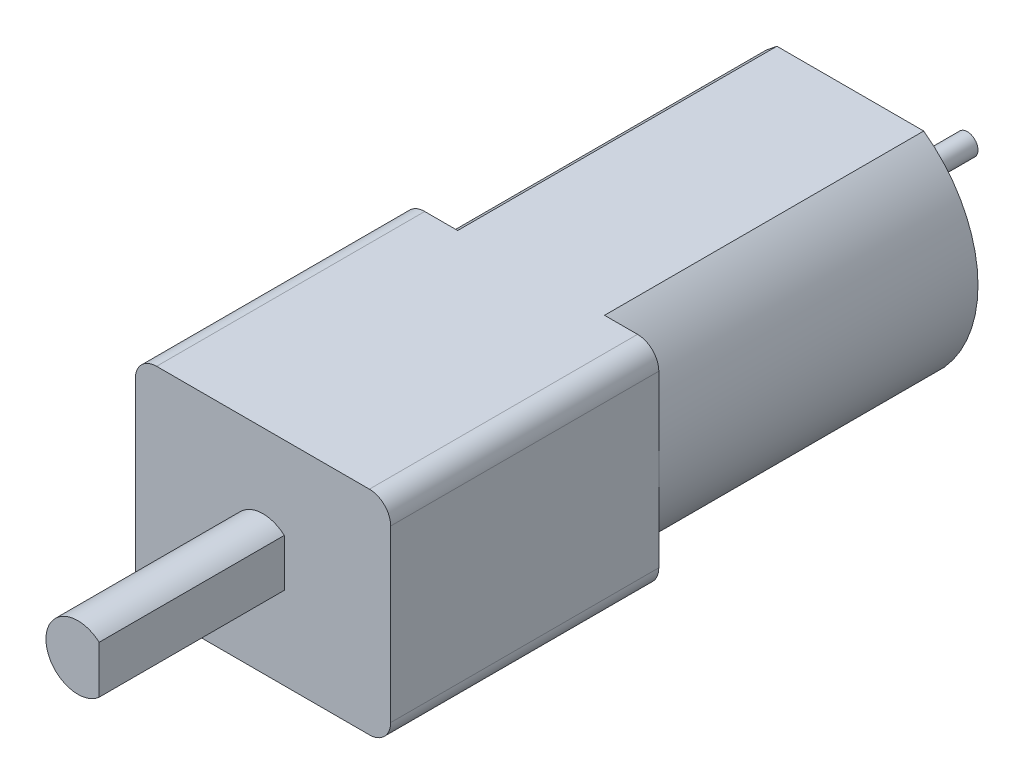
ISO-10303-21;
HEADER;
FILE_DESCRIPTION(('STEP AP214'),'2;1');
FILE_NAME('part.step','',(''),(''),'','','');
FILE_SCHEMA(('AUTOMOTIVE_DESIGN { 1 0 10303 214 1 1 1 1 }'));
ENDSEC;
DATA;
#1=APPLICATION_CONTEXT('core data for automotive mechanical design processes');
#2=APPLICATION_PROTOCOL_DEFINITION('international standard','automotive_design',2000,#1);
#3=PRODUCT_CONTEXT('',#1,'mechanical');
#4=PRODUCT('Part','Part','',(#3));
#5=PRODUCT_RELATED_PRODUCT_CATEGORY('part','',(#4));
#6=PRODUCT_DEFINITION_FORMATION('','',#4);
#7=PRODUCT_DEFINITION_CONTEXT('part definition',#1,'design');
#8=PRODUCT_DEFINITION('design','',#6,#7);
#9=PRODUCT_DEFINITION_SHAPE('','',#8);
#10=(LENGTH_UNIT() NAMED_UNIT(*) SI_UNIT(.MILLI.,.METRE.));
#11=(NAMED_UNIT(*) PLANE_ANGLE_UNIT() SI_UNIT($,.RADIAN.));
#12=(NAMED_UNIT(*) SI_UNIT($,.STERADIAN.) SOLID_ANGLE_UNIT());
#13=UNCERTAINTY_MEASURE_WITH_UNIT(LENGTH_MEASURE(1.E-05),#10,'distance_accuracy_value','');
#14=(GEOMETRIC_REPRESENTATION_CONTEXT(3) GLOBAL_UNCERTAINTY_ASSIGNED_CONTEXT((#13)) GLOBAL_UNIT_ASSIGNED_CONTEXT((#10,
#11,#12)) REPRESENTATION_CONTEXT('',''));
#15=CARTESIAN_POINT('',(0.,0.,0.));
#16=DIRECTION('',(0.,0.,1.));
#17=DIRECTION('',(1.,0.,0.));
#18=AXIS2_PLACEMENT_3D('',#15,#16,#17);
#19=CARTESIAN_POINT('',(-0.17696078431373,0.,15.));
#20=DIRECTION('',(0.,0.,-1.));
#21=DIRECTION('',(-1.,0.,0.));
#22=AXIS2_PLACEMENT_3D('',#19,#20,#21);
#23=CYLINDRICAL_SURFACE('',#22,6.17696078431373);
#24=CARTESIAN_POINT('',(-0.17696078431373,0.,0.));
#25=DIRECTION('',(0.,0.,1.));
#26=DIRECTION('',(-1.,0.,0.));
#27=AXIS2_PLACEMENT_3D('',#24,#25,#26);
#28=CIRCLE('',#27,6.17696078431373);
#29=CARTESIAN_POINT('',(3.45,-5.,0.));
#30=VERTEX_POINT('',#29);
#31=CARTESIAN_POINT('',(3.45,5.,0.));
#32=VERTEX_POINT('',#31);
#33=EDGE_CURVE('E177',#30,#32,#28,.T.);
#34=ORIENTED_EDGE('',*,*,#33,.T.);
#35=DIRECTION('',(0.,0.,-1.));
#36=VECTOR('',#35,1.);
#37=CARTESIAN_POINT('',(3.45,5.,15.));
#38=LINE('',#37,#36);
#39=CARTESIAN_POINT('',(3.45,5.,15.));
#40=VERTEX_POINT('',#39);
#41=EDGE_CURVE('E212',#40,#32,#38,.T.);
#42=ORIENTED_EDGE('',*,*,#41,.F.);
#43=CARTESIAN_POINT('',(-0.17696078431373,0.,15.));
#44=DIRECTION('',(0.,0.,1.));
#45=DIRECTION('',(-1.,0.,0.));
#46=AXIS2_PLACEMENT_3D('',#43,#44,#45);
#47=CIRCLE('',#46,6.17696078431373);
#48=CARTESIAN_POINT('',(6.,0.,15.));
#49=VERTEX_POINT('',#48);
#50=EDGE_CURVE('E191',#49,#40,#47,.T.);
#51=ORIENTED_EDGE('',*,*,#50,.F.);
#52=CARTESIAN_POINT('',(3.45,-5.,15.));
#53=VERTEX_POINT('',#52);
#54=EDGE_CURVE('E187',#53,#49,#47,.T.);
#55=ORIENTED_EDGE('',*,*,#54,.F.);
#56=DIRECTION('',(0.,0.,-1.));
#57=VECTOR('',#56,1.);
#58=CARTESIAN_POINT('',(3.45,-5.,15.));
#59=LINE('',#58,#57);
#60=EDGE_CURVE('E195',#53,#30,#59,.T.);
#61=ORIENTED_EDGE('',*,*,#60,.T.);
#62=EDGE_LOOP('',(#34,#42,#51,#55,#61));
#63=FACE_BOUND('',#62,.T.);
#64=ADVANCED_FACE('F32',(#63),#23,.T.);
#65=CARTESIAN_POINT('',(-3.45,5.,15.));
#66=DIRECTION('',(0.,-1.,0.));
#67=DIRECTION('',(0.,0.,-1.));
#68=AXIS2_PLACEMENT_3D('',#65,#66,#67);
#69=PLANE('',#68);
#70=DIRECTION('',(-1.,0.,0.));
#71=VECTOR('',#70,1.);
#72=CARTESIAN_POINT('',(-6.,5.,27.6));
#73=LINE('',#72,#71);
#74=CARTESIAN_POINT('',(5.,5.,27.6));
#75=VERTEX_POINT('',#74);
#76=CARTESIAN_POINT('',(-5.,5.,27.6));
#77=VERTEX_POINT('',#76);
#78=EDGE_CURVE('E168',#75,#77,#73,.T.);
#79=ORIENTED_EDGE('',*,*,#78,.F.);
#80=DIRECTION('',(0.,0.,-1.));
#81=VECTOR('',#80,1.);
#82=CARTESIAN_POINT('',(5.,5.,15.));
#83=LINE('',#82,#81);
#84=CARTESIAN_POINT('',(5.,5.,15.));
#85=VERTEX_POINT('',#84);
#86=EDGE_CURVE('E217',#75,#85,#83,.T.);
#87=ORIENTED_EDGE('',*,*,#86,.T.);
#88=DIRECTION('',(-1.,0.,0.));
#89=VECTOR('',#88,1.);
#90=CARTESIAN_POINT('',(-6.,5.,15.));
#91=LINE('',#90,#89);
#92=EDGE_CURVE('E180',#85,#40,#91,.T.);
#93=ORIENTED_EDGE('',*,*,#92,.T.);
#94=ORIENTED_EDGE('',*,*,#41,.T.);
#95=DIRECTION('',(-1.,0.,0.));
#96=VECTOR('',#95,1.);
#97=CARTESIAN_POINT('',(-3.45,5.,0.));
#98=LINE('',#97,#96);
#99=CARTESIAN_POINT('',(-3.45,5.,0.));
#100=VERTEX_POINT('',#99);
#101=EDGE_CURVE('E198',#32,#100,#98,.T.);
#102=ORIENTED_EDGE('',*,*,#101,.T.);
#103=DIRECTION('',(0.,0.,-1.));
#104=VECTOR('',#103,1.);
#105=CARTESIAN_POINT('',(-3.45,5.,15.));
#106=LINE('',#105,#104);
#107=CARTESIAN_POINT('',(-3.45,5.,15.));
#108=VERTEX_POINT('',#107);
#109=EDGE_CURVE('E209',#108,#100,#106,.T.);
#110=ORIENTED_EDGE('',*,*,#109,.F.);
#111=CARTESIAN_POINT('',(-5.,5.,15.));
#112=VERTEX_POINT('',#111);
#113=EDGE_CURVE('E179',#108,#112,#91,.T.);
#114=ORIENTED_EDGE('',*,*,#113,.T.);
#115=DIRECTION('',(0.,0.,-1.));
#116=VECTOR('',#115,1.);
#117=CARTESIAN_POINT('',(-5.,5.,15.));
#118=LINE('',#117,#116);
#119=EDGE_CURVE('E215',#112,#77,#118,.F.);
#120=ORIENTED_EDGE('',*,*,#119,.T.);
#121=EDGE_LOOP('',(#79,#87,#93,#94,#102,#110,#114,#120));
#122=FACE_BOUND('',#121,.T.);
#123=ADVANCED_FACE('F287',(#122),#69,.F.);
#124=CARTESIAN_POINT('',(0.17696078431372,0.,15.));
#125=DIRECTION('',(0.,0.,-1.));
#126=DIRECTION('',(-1.,0.,0.));
#127=AXIS2_PLACEMENT_3D('',#124,#125,#126);
#128=CYLINDRICAL_SURFACE('',#127,6.17696078431372);
#129=CARTESIAN_POINT('',(0.17696078431372,0.,0.));
#130=DIRECTION('',(0.,0.,1.));
#131=DIRECTION('',(1.,0.,0.));
#132=AXIS2_PLACEMENT_3D('',#129,#130,#131);
#133=CIRCLE('',#132,6.17696078431372);
#134=CARTESIAN_POINT('',(-3.45,-5.,0.));
#135=VERTEX_POINT('',#134);
#136=EDGE_CURVE('E200',#100,#135,#133,.T.);
#137=ORIENTED_EDGE('',*,*,#136,.T.);
#138=DIRECTION('',(0.,0.,-1.));
#139=VECTOR('',#138,1.);
#140=CARTESIAN_POINT('',(-3.45,-5.,15.));
#141=LINE('',#140,#139);
#142=CARTESIAN_POINT('',(-3.45,-5.,15.));
#143=VERTEX_POINT('',#142);
#144=EDGE_CURVE('E206',#143,#135,#141,.T.);
#145=ORIENTED_EDGE('',*,*,#144,.F.);
#146=CARTESIAN_POINT('',(0.17696078431372,0.,15.));
#147=DIRECTION('',(0.,0.,1.));
#148=DIRECTION('',(1.,0.,0.));
#149=AXIS2_PLACEMENT_3D('',#146,#147,#148);
#150=CIRCLE('',#149,6.17696078431372);
#151=CARTESIAN_POINT('',(-6.,0.,15.));
#152=VERTEX_POINT('',#151);
#153=EDGE_CURVE('E190',#152,#143,#150,.T.);
#154=ORIENTED_EDGE('',*,*,#153,.F.);
#155=EDGE_CURVE('E192',#108,#152,#150,.T.);
#156=ORIENTED_EDGE('',*,*,#155,.F.);
#157=ORIENTED_EDGE('',*,*,#109,.T.);
#158=EDGE_LOOP('',(#137,#145,#154,#156,#157));
#159=FACE_BOUND('',#158,.T.);
#160=ADVANCED_FACE('F293',(#159),#128,.T.);
#161=CARTESIAN_POINT('',(-3.45,-5.,15.));
#162=DIRECTION('',(0.,1.,0.));
#163=DIRECTION('',(0.,0.,1.));
#164=AXIS2_PLACEMENT_3D('',#161,#162,#163);
#165=PLANE('',#164);
#166=DIRECTION('',(1.,0.,0.));
#167=VECTOR('',#166,1.);
#168=CARTESIAN_POINT('',(-6.,-5.,15.));
#169=LINE('',#168,#167);
#170=CARTESIAN_POINT('',(5.,-5.,15.));
#171=VERTEX_POINT('',#170);
#172=EDGE_CURVE('E185',#53,#171,#169,.T.);
#173=ORIENTED_EDGE('',*,*,#172,.T.);
#174=DIRECTION('',(0.,0.,-1.));
#175=VECTOR('',#174,1.);
#176=CARTESIAN_POINT('',(5.,-5.,15.));
#177=LINE('',#176,#175);
#178=CARTESIAN_POINT('',(5.,-5.,27.6));
#179=VERTEX_POINT('',#178);
#180=EDGE_CURVE('E240',#171,#179,#177,.F.);
#181=ORIENTED_EDGE('',*,*,#180,.T.);
#182=DIRECTION('',(1.,0.,0.));
#183=VECTOR('',#182,1.);
#184=CARTESIAN_POINT('',(-6.,-5.,27.6));
#185=LINE('',#184,#183);
#186=CARTESIAN_POINT('',(-5.,-5.,27.6));
#187=VERTEX_POINT('',#186);
#188=EDGE_CURVE('E175',#187,#179,#185,.T.);
#189=ORIENTED_EDGE('',*,*,#188,.F.);
#190=DIRECTION('',(0.,0.,-1.));
#191=VECTOR('',#190,1.);
#192=CARTESIAN_POINT('',(-5.,-5.,15.));
#193=LINE('',#192,#191);
#194=CARTESIAN_POINT('',(-5.,-5.,15.));
#195=VERTEX_POINT('',#194);
#196=EDGE_CURVE('E237',#187,#195,#193,.T.);
#197=ORIENTED_EDGE('',*,*,#196,.T.);
#198=EDGE_CURVE('E169',#195,#143,#169,.T.);
#199=ORIENTED_EDGE('',*,*,#198,.T.);
#200=ORIENTED_EDGE('',*,*,#144,.T.);
#201=DIRECTION('',(1.,0.,0.));
#202=VECTOR('',#201,1.);
#203=CARTESIAN_POINT('',(-3.45,-5.,0.));
#204=LINE('',#203,#202);
#205=EDGE_CURVE('E202',#135,#30,#204,.T.);
#206=ORIENTED_EDGE('',*,*,#205,.T.);
#207=ORIENTED_EDGE('',*,*,#60,.F.);
#208=EDGE_LOOP('',(#173,#181,#189,#197,#199,#200,#206,#207));
#209=FACE_BOUND('',#208,.T.);
#210=ADVANCED_FACE('F319',(#209),#165,.F.);
#211=CARTESIAN_POINT('',(-0.17696078431373,0.,0.));
#212=DIRECTION('',(0.,0.,-1.));
#213=DIRECTION('',(-1.,0.,0.));
#214=AXIS2_PLACEMENT_3D('',#211,#212,#213);
#215=PLANE('',#214);
#216=CARTESIAN_POINT('',(0.,0.,0.));
#217=DIRECTION('',(0.,0.,-1.));
#218=DIRECTION('',(-1.,0.,0.));
#219=AXIS2_PLACEMENT_3D('',#216,#217,#218);
#220=CIRCLE('',#219,2.5);
#221=CARTESIAN_POINT('',(-2.5,0.,0.));
#222=VERTEX_POINT('',#221);
#223=EDGE_CURVE('E41',#222,#222,#220,.T.);
#224=ORIENTED_EDGE('',*,*,#223,.F.);
#225=EDGE_LOOP('',(#224));
#226=FACE_BOUND('',#225,.T.);
#227=ORIENTED_EDGE('',*,*,#33,.F.);
#228=ORIENTED_EDGE('',*,*,#205,.F.);
#229=ORIENTED_EDGE('',*,*,#136,.F.);
#230=ORIENTED_EDGE('',*,*,#101,.F.);
#231=EDGE_LOOP('',(#227,#228,#229,#230));
#232=FACE_BOUND('',#231,.T.);
#233=ADVANCED_FACE('F349',(#226,#232),#215,.T.);
#234=CARTESIAN_POINT('',(0.,0.,15.));
#235=DIRECTION('',(0.,0.,1.));
#236=DIRECTION('',(1.,0.,0.));
#237=AXIS2_PLACEMENT_3D('',#234,#235,#236);
#238=PLANE('',#237);
#239=DIRECTION('',(0.,1.,0.));
#240=VECTOR('',#239,1.);
#241=CARTESIAN_POINT('',(6.,5.,15.));
#242=LINE('',#241,#240);
#243=CARTESIAN_POINT('',(6.,-4.,15.));
#244=VERTEX_POINT('',#243);
#245=EDGE_CURVE('E160',#244,#49,#242,.T.);
#246=ORIENTED_EDGE('',*,*,#245,.F.);
#247=CARTESIAN_POINT('',(5.,-4.,15.));
#248=DIRECTION('',(0.,0.,1.));
#249=DIRECTION('',(1.,0.,0.));
#250=AXIS2_PLACEMENT_3D('',#247,#248,#249);
#251=CIRCLE('',#250,1.);
#252=EDGE_CURVE('E235',#244,#171,#251,.F.);
#253=ORIENTED_EDGE('',*,*,#252,.T.);
#254=ORIENTED_EDGE('',*,*,#172,.F.);
#255=ORIENTED_EDGE('',*,*,#54,.T.);
#256=EDGE_LOOP('',(#246,#253,#254,#255));
#257=FACE_BOUND('',#256,.T.);
#258=ADVANCED_FACE('F355',(#257),#238,.F.);
#259=ORIENTED_EDGE('',*,*,#92,.F.);
#260=CARTESIAN_POINT('',(5.,4.,15.));
#261=DIRECTION('',(0.,0.,1.));
#262=DIRECTION('',(1.,0.,0.));
#263=AXIS2_PLACEMENT_3D('',#260,#261,#262);
#264=CIRCLE('',#263,1.);
#265=CARTESIAN_POINT('',(6.,4.,15.));
#266=VERTEX_POINT('',#265);
#267=EDGE_CURVE('E220',#85,#266,#264,.F.);
#268=ORIENTED_EDGE('',*,*,#267,.T.);
#269=EDGE_CURVE('E157',#49,#266,#242,.T.);
#270=ORIENTED_EDGE('',*,*,#269,.F.);
#271=ORIENTED_EDGE('',*,*,#50,.T.);
#272=EDGE_LOOP('',(#259,#268,#270,#271));
#273=FACE_BOUND('',#272,.T.);
#274=ADVANCED_FACE('F357',(#273),#238,.F.);
#275=DIRECTION('',(0.,-1.,0.));
#276=VECTOR('',#275,1.);
#277=CARTESIAN_POINT('',(-6.,5.,15.));
#278=LINE('',#277,#276);
#279=CARTESIAN_POINT('',(-6.,4.,15.));
#280=VERTEX_POINT('',#279);
#281=EDGE_CURVE('E183',#280,#152,#278,.T.);
#282=ORIENTED_EDGE('',*,*,#281,.F.);
#283=CARTESIAN_POINT('',(-5.,4.,15.));
#284=DIRECTION('',(0.,0.,1.));
#285=DIRECTION('',(1.,0.,0.));
#286=AXIS2_PLACEMENT_3D('',#283,#284,#285);
#287=CIRCLE('',#286,1.);
#288=EDGE_CURVE('E36',#280,#112,#287,.F.);
#289=ORIENTED_EDGE('',*,*,#288,.T.);
#290=ORIENTED_EDGE('',*,*,#113,.F.);
#291=ORIENTED_EDGE('',*,*,#155,.T.);
#292=EDGE_LOOP('',(#282,#289,#290,#291));
#293=FACE_BOUND('',#292,.T.);
#294=ADVANCED_FACE('F337',(#293),#238,.F.);
#295=ORIENTED_EDGE('',*,*,#198,.F.);
#296=CARTESIAN_POINT('',(-5.,-4.,15.));
#297=DIRECTION('',(0.,0.,1.));
#298=DIRECTION('',(1.,0.,0.));
#299=AXIS2_PLACEMENT_3D('',#296,#297,#298);
#300=CIRCLE('',#299,1.);
#301=CARTESIAN_POINT('',(-6.,-4.,15.));
#302=VERTEX_POINT('',#301);
#303=EDGE_CURVE('E242',#195,#302,#300,.F.);
#304=ORIENTED_EDGE('',*,*,#303,.T.);
#305=EDGE_CURVE('E182',#152,#302,#278,.T.);
#306=ORIENTED_EDGE('',*,*,#305,.F.);
#307=ORIENTED_EDGE('',*,*,#153,.T.);
#308=EDGE_LOOP('',(#295,#304,#306,#307));
#309=FACE_BOUND('',#308,.T.);
#310=ADVANCED_FACE('F343',(#309),#238,.F.);
#311=CARTESIAN_POINT('',(6.,5.,27.6));
#312=DIRECTION('',(-1.,0.,0.));
#313=DIRECTION('',(0.,-1.,0.));
#314=AXIS2_PLACEMENT_3D('',#311,#312,#313);
#315=PLANE('',#314);
#316=ORIENTED_EDGE('',*,*,#269,.T.);
#317=DIRECTION('',(0.,0.,-1.));
#318=VECTOR('',#317,1.);
#319=CARTESIAN_POINT('',(6.,4.,27.6));
#320=LINE('',#319,#318);
#321=CARTESIAN_POINT('',(6.,4.,27.6));
#322=VERTEX_POINT('',#321);
#323=EDGE_CURVE('E225',#266,#322,#320,.F.);
#324=ORIENTED_EDGE('',*,*,#323,.T.);
#325=DIRECTION('',(0.,1.,0.));
#326=VECTOR('',#325,1.);
#327=CARTESIAN_POINT('',(6.,5.,27.6));
#328=LINE('',#327,#326);
#329=CARTESIAN_POINT('',(6.,-4.,27.6));
#330=VERTEX_POINT('',#329);
#331=EDGE_CURVE('E165',#330,#322,#328,.T.);
#332=ORIENTED_EDGE('',*,*,#331,.F.);
#333=DIRECTION('',(0.,0.,-1.));
#334=VECTOR('',#333,1.);
#335=CARTESIAN_POINT('',(6.,-4.,27.6));
#336=LINE('',#335,#334);
#337=EDGE_CURVE('E222',#330,#244,#336,.T.);
#338=ORIENTED_EDGE('',*,*,#337,.T.);
#339=ORIENTED_EDGE('',*,*,#245,.T.);
#340=EDGE_LOOP('',(#316,#324,#332,#338,#339));
#341=FACE_BOUND('',#340,.T.);
#342=ADVANCED_FACE('F327',(#341),#315,.F.);
#343=CARTESIAN_POINT('',(-6.,5.,27.6));
#344=DIRECTION('',(1.,0.,0.));
#345=DIRECTION('',(0.,1.,0.));
#346=AXIS2_PLACEMENT_3D('',#343,#344,#345);
#347=PLANE('',#346);
#348=ORIENTED_EDGE('',*,*,#305,.T.);
#349=DIRECTION('',(0.,0.,-1.));
#350=VECTOR('',#349,1.);
#351=CARTESIAN_POINT('',(-6.,-4.,27.6));
#352=LINE('',#351,#350);
#353=CARTESIAN_POINT('',(-6.,-4.,27.6));
#354=VERTEX_POINT('',#353);
#355=EDGE_CURVE('E245',#302,#354,#352,.F.);
#356=ORIENTED_EDGE('',*,*,#355,.T.);
#357=DIRECTION('',(0.,-1.,0.));
#358=VECTOR('',#357,1.);
#359=CARTESIAN_POINT('',(-6.,5.,27.6));
#360=LINE('',#359,#358);
#361=CARTESIAN_POINT('',(-6.,4.,27.6));
#362=VERTEX_POINT('',#361);
#363=EDGE_CURVE('E172',#362,#354,#360,.T.);
#364=ORIENTED_EDGE('',*,*,#363,.F.);
#365=DIRECTION('',(0.,0.,-1.));
#366=VECTOR('',#365,1.);
#367=CARTESIAN_POINT('',(-6.,4.,27.6));
#368=LINE('',#367,#366);
#369=EDGE_CURVE('E244',#362,#280,#368,.T.);
#370=ORIENTED_EDGE('',*,*,#369,.T.);
#371=ORIENTED_EDGE('',*,*,#281,.T.);
#372=EDGE_LOOP('',(#348,#356,#364,#370,#371));
#373=FACE_BOUND('',#372,.T.);
#374=ADVANCED_FACE('F335',(#373),#347,.F.);
#375=CARTESIAN_POINT('',(0.,0.,27.6));
#376=DIRECTION('',(0.,0.,1.));
#377=DIRECTION('',(1.,0.,0.));
#378=AXIS2_PLACEMENT_3D('',#375,#376,#377);
#379=PLANE('',#378);
#380=CARTESIAN_POINT('',(0.,0.,27.6));
#381=DIRECTION('',(0.,0.,1.));
#382=DIRECTION('',(1.,0.,0.));
#383=AXIS2_PLACEMENT_3D('',#380,#381,#382);
#384=CIRCLE('',#383,1.5);
#385=CARTESIAN_POINT('',(1.,1.1180339887499,27.6));
#386=VERTEX_POINT('',#385);
#387=CARTESIAN_POINT('',(1.,-1.1180339887499,27.6));
#388=VERTEX_POINT('',#387);
#389=EDGE_CURVE('E156',#386,#388,#384,.T.);
#390=ORIENTED_EDGE('',*,*,#389,.F.);
#391=DIRECTION('',(0.,1.,0.));
#392=VECTOR('',#391,1.);
#393=CARTESIAN_POINT('',(1.,1.1180339887499,27.6));
#394=LINE('',#393,#392);
#395=EDGE_CURVE('E48',#388,#386,#394,.T.);
#396=ORIENTED_EDGE('',*,*,#395,.F.);
#397=EDGE_LOOP('',(#390,#396));
#398=FACE_BOUND('',#397,.T.);
#399=ORIENTED_EDGE('',*,*,#331,.T.);
#400=CARTESIAN_POINT('',(5.,4.,27.6));
#401=DIRECTION('',(0.,0.,1.));
#402=DIRECTION('',(1.,0.,0.));
#403=AXIS2_PLACEMENT_3D('',#400,#401,#402);
#404=CIRCLE('',#403,1.);
#405=EDGE_CURVE('E233',#322,#75,#404,.T.);
#406=ORIENTED_EDGE('',*,*,#405,.T.);
#407=ORIENTED_EDGE('',*,*,#78,.T.);
#408=CARTESIAN_POINT('',(-5.,4.,27.6));
#409=DIRECTION('',(0.,0.,1.));
#410=DIRECTION('',(1.,0.,0.));
#411=AXIS2_PLACEMENT_3D('',#408,#409,#410);
#412=CIRCLE('',#411,1.);
#413=EDGE_CURVE('E227',#77,#362,#412,.T.);
#414=ORIENTED_EDGE('',*,*,#413,.T.);
#415=ORIENTED_EDGE('',*,*,#363,.T.);
#416=CARTESIAN_POINT('',(-5.,-4.,27.6));
#417=DIRECTION('',(0.,0.,1.));
#418=DIRECTION('',(1.,0.,0.));
#419=AXIS2_PLACEMENT_3D('',#416,#417,#418);
#420=CIRCLE('',#419,1.);
#421=EDGE_CURVE('E229',#354,#187,#420,.T.);
#422=ORIENTED_EDGE('',*,*,#421,.T.);
#423=ORIENTED_EDGE('',*,*,#188,.T.);
#424=CARTESIAN_POINT('',(5.,-4.,27.6));
#425=DIRECTION('',(0.,0.,1.));
#426=DIRECTION('',(1.,0.,0.));
#427=AXIS2_PLACEMENT_3D('',#424,#425,#426);
#428=CIRCLE('',#427,1.);
#429=EDGE_CURVE('E231',#179,#330,#428,.T.);
#430=ORIENTED_EDGE('',*,*,#429,.T.);
#431=EDGE_LOOP('',(#399,#406,#407,#414,#415,#422,#423,#430));
#432=FACE_BOUND('',#431,.T.);
#433=ADVANCED_FACE('F302',(#398,#432),#379,.T.);
#434=CARTESIAN_POINT('',(5.,4.,15.));
#435=DIRECTION('',(0.,0.,-1.));
#436=DIRECTION('',(-1.,0.,0.));
#437=AXIS2_PLACEMENT_3D('',#434,#435,#436);
#438=CYLINDRICAL_SURFACE('',#437,1.);
#439=ORIENTED_EDGE('',*,*,#405,.F.);
#440=ORIENTED_EDGE('',*,*,#323,.F.);
#441=ORIENTED_EDGE('',*,*,#267,.F.);
#442=ORIENTED_EDGE('',*,*,#86,.F.);
#443=EDGE_LOOP('',(#439,#440,#441,#442));
#444=FACE_BOUND('',#443,.T.);
#445=ADVANCED_FACE('F298',(#444),#438,.T.);
#446=CARTESIAN_POINT('',(5.,-4.,27.6));
#447=DIRECTION('',(0.,0.,-1.));
#448=DIRECTION('',(-1.,0.,0.));
#449=AXIS2_PLACEMENT_3D('',#446,#447,#448);
#450=CYLINDRICAL_SURFACE('',#449,1.);
#451=ORIENTED_EDGE('',*,*,#429,.F.);
#452=ORIENTED_EDGE('',*,*,#180,.F.);
#453=ORIENTED_EDGE('',*,*,#252,.F.);
#454=ORIENTED_EDGE('',*,*,#337,.F.);
#455=EDGE_LOOP('',(#451,#452,#453,#454));
#456=FACE_BOUND('',#455,.T.);
#457=ADVANCED_FACE('F301',(#456),#450,.T.);
#458=CARTESIAN_POINT('',(-5.,-4.,15.));
#459=DIRECTION('',(0.,0.,-1.));
#460=DIRECTION('',(-1.,0.,0.));
#461=AXIS2_PLACEMENT_3D('',#458,#459,#460);
#462=CYLINDRICAL_SURFACE('',#461,1.);
#463=ORIENTED_EDGE('',*,*,#421,.F.);
#464=ORIENTED_EDGE('',*,*,#355,.F.);
#465=ORIENTED_EDGE('',*,*,#303,.F.);
#466=ORIENTED_EDGE('',*,*,#196,.F.);
#467=EDGE_LOOP('',(#463,#464,#465,#466));
#468=FACE_BOUND('',#467,.T.);
#469=ADVANCED_FACE('F305',(#468),#462,.T.);
#470=CARTESIAN_POINT('',(-5.,4.,27.6));
#471=DIRECTION('',(0.,0.,-1.));
#472=DIRECTION('',(-1.,0.,0.));
#473=AXIS2_PLACEMENT_3D('',#470,#471,#472);
#474=CYLINDRICAL_SURFACE('',#473,1.);
#475=ORIENTED_EDGE('',*,*,#413,.F.);
#476=ORIENTED_EDGE('',*,*,#119,.F.);
#477=ORIENTED_EDGE('',*,*,#288,.F.);
#478=ORIENTED_EDGE('',*,*,#369,.F.);
#479=EDGE_LOOP('',(#475,#476,#477,#478));
#480=FACE_BOUND('',#479,.T.);
#481=ADVANCED_FACE('F34',(#480),#474,.T.);
#482=CARTESIAN_POINT('',(0.,0.,36.3));
#483=DIRECTION('',(0.,0.,-1.));
#484=DIRECTION('',(-1.,0.,0.));
#485=AXIS2_PLACEMENT_3D('',#482,#483,#484);
#486=CYLINDRICAL_SURFACE('',#485,1.5);
#487=ORIENTED_EDGE('',*,*,#389,.T.);
#488=DIRECTION('',(0.,0.,-1.));
#489=VECTOR('',#488,1.);
#490=CARTESIAN_POINT('',(1.,-1.1180339887499,36.3));
#491=LINE('',#490,#489);
#492=CARTESIAN_POINT('',(1.,-1.1180339887499,36.3));
#493=VERTEX_POINT('',#492);
#494=EDGE_CURVE('E144',#493,#388,#491,.T.);
#495=ORIENTED_EDGE('',*,*,#494,.F.);
#496=CARTESIAN_POINT('',(0.,0.,36.3));
#497=DIRECTION('',(0.,0.,1.));
#498=DIRECTION('',(1.,0.,0.));
#499=AXIS2_PLACEMENT_3D('',#496,#497,#498);
#500=CIRCLE('',#499,1.5);
#501=CARTESIAN_POINT('',(1.,1.1180339887499,36.3));
#502=VERTEX_POINT('',#501);
#503=EDGE_CURVE('E150',#502,#493,#500,.T.);
#504=ORIENTED_EDGE('',*,*,#503,.F.);
#505=DIRECTION('',(0.,0.,-1.));
#506=VECTOR('',#505,1.);
#507=CARTESIAN_POINT('',(1.,1.1180339887499,36.3));
#508=LINE('',#507,#506);
#509=EDGE_CURVE('E147',#502,#386,#508,.T.);
#510=ORIENTED_EDGE('',*,*,#509,.T.);
#511=EDGE_LOOP('',(#487,#495,#504,#510));
#512=FACE_BOUND('',#511,.T.);
#513=ADVANCED_FACE('F155',(#512),#486,.T.);
#514=CARTESIAN_POINT('',(1.,1.1180339887499,36.3));
#515=DIRECTION('',(-1.,0.,0.));
#516=DIRECTION('',(0.,0.,1.));
#517=AXIS2_PLACEMENT_3D('',#514,#515,#516);
#518=PLANE('',#517);
#519=ORIENTED_EDGE('',*,*,#395,.T.);
#520=ORIENTED_EDGE('',*,*,#509,.F.);
#521=DIRECTION('',(0.,1.,0.));
#522=VECTOR('',#521,1.);
#523=CARTESIAN_POINT('',(1.,1.1180339887499,36.3));
#524=LINE('',#523,#522);
#525=EDGE_CURVE('E140',#493,#502,#524,.T.);
#526=ORIENTED_EDGE('',*,*,#525,.F.);
#527=ORIENTED_EDGE('',*,*,#494,.T.);
#528=EDGE_LOOP('',(#519,#520,#526,#527));
#529=FACE_BOUND('',#528,.T.);
#530=ADVANCED_FACE('F142',(#529),#518,.F.);
#531=CARTESIAN_POINT('',(0.,0.,36.3));
#532=DIRECTION('',(0.,0.,1.));
#533=DIRECTION('',(1.,0.,0.));
#534=AXIS2_PLACEMENT_3D('',#531,#532,#533);
#535=PLANE('',#534);
#536=ORIENTED_EDGE('',*,*,#503,.T.);
#537=ORIENTED_EDGE('',*,*,#525,.T.);
#538=EDGE_LOOP('',(#536,#537));
#539=FACE_BOUND('',#538,.T.);
#540=ADVANCED_FACE('F152',(#539),#535,.T.);
#541=CARTESIAN_POINT('',(0.,0.,-1.3));
#542=DIRECTION('',(0.,0.,1.));
#543=DIRECTION('',(1.,0.,0.));
#544=AXIS2_PLACEMENT_3D('',#541,#542,#543);
#545=CYLINDRICAL_SURFACE('',#544,2.5);
#546=CARTESIAN_POINT('',(0.,0.,-1.3));
#547=DIRECTION('',(0.,0.,-1.));
#548=DIRECTION('',(-1.,0.,0.));
#549=AXIS2_PLACEMENT_3D('',#546,#547,#548);
#550=CIRCLE('',#549,2.5);
#551=CARTESIAN_POINT('',(-2.5,0.,-1.3));
#552=VERTEX_POINT('',#551);
#553=EDGE_CURVE('E259',#552,#552,#550,.T.);
#554=ORIENTED_EDGE('',*,*,#553,.F.);
#555=EDGE_LOOP('',(#554));
#556=FACE_BOUND('',#555,.T.);
#557=ORIENTED_EDGE('',*,*,#223,.T.);
#558=EDGE_LOOP('',(#557));
#559=FACE_BOUND('',#558,.T.);
#560=ADVANCED_FACE('F279',(#556,#559),#545,.T.);
#561=CARTESIAN_POINT('',(0.,0.,-1.3));
#562=DIRECTION('',(0.,0.,-1.));
#563=DIRECTION('',(-1.,0.,0.));
#564=AXIS2_PLACEMENT_3D('',#561,#562,#563);
#565=PLANE('',#564);
#566=CARTESIAN_POINT('',(0.,0.,-1.3));
#567=DIRECTION('',(0.,0.,-1.));
#568=DIRECTION('',(-1.,0.,0.));
#569=AXIS2_PLACEMENT_3D('',#566,#567,#568);
#570=CIRCLE('',#569,0.5);
#571=CARTESIAN_POINT('',(-0.5,0.,-1.3));
#572=VERTEX_POINT('',#571);
#573=EDGE_CURVE('E11',#572,#572,#570,.T.);
#574=ORIENTED_EDGE('',*,*,#573,.F.);
#575=EDGE_LOOP('',(#574));
#576=FACE_BOUND('',#575,.T.);
#577=ORIENTED_EDGE('',*,*,#553,.T.);
#578=EDGE_LOOP('',(#577));
#579=FACE_BOUND('',#578,.T.);
#580=ADVANCED_FACE('F274',(#576,#579),#565,.T.);
#581=CARTESIAN_POINT('',(0.,0.,-5.5));
#582=DIRECTION('',(0.,0.,1.));
#583=DIRECTION('',(1.,0.,0.));
#584=AXIS2_PLACEMENT_3D('',#581,#582,#583);
#585=CYLINDRICAL_SURFACE('',#584,0.5);
#586=CARTESIAN_POINT('',(0.,0.,-5.5));
#587=DIRECTION('',(0.,0.,-1.));
#588=DIRECTION('',(-1.,0.,0.));
#589=AXIS2_PLACEMENT_3D('',#586,#587,#588);
#590=CIRCLE('',#589,0.5);
#591=CARTESIAN_POINT('',(-0.5,0.,-5.5));
#592=VERTEX_POINT('',#591);
#593=EDGE_CURVE('E262',#592,#592,#590,.T.);
#594=ORIENTED_EDGE('',*,*,#593,.F.);
#595=EDGE_LOOP('',(#594));
#596=FACE_BOUND('',#595,.T.);
#597=ORIENTED_EDGE('',*,*,#573,.T.);
#598=EDGE_LOOP('',(#597));
#599=FACE_BOUND('',#598,.T.);
#600=ADVANCED_FACE('F271',(#596,#599),#585,.T.);
#601=CARTESIAN_POINT('',(0.,0.,-5.5));
#602=DIRECTION('',(0.,0.,-1.));
#603=DIRECTION('',(-1.,0.,0.));
#604=AXIS2_PLACEMENT_3D('',#601,#602,#603);
#605=PLANE('',#604);
#606=ORIENTED_EDGE('',*,*,#593,.T.);
#607=EDGE_LOOP('',(#606));
#608=FACE_BOUND('',#607,.T.);
#609=ADVANCED_FACE('F269',(#608),#605,.T.);
#610=CLOSED_SHELL('',(#64,#123,#160,#210,#233,#258,#274,#294,#310,#342,#374,#433,#445,#457,#469,
#481,#513,#530,#540,#560,#580,#600,#609));
#611=MANIFOLD_SOLID_BREP('B2',#610);
#612=ADVANCED_BREP_SHAPE_REPRESENTATION('',(#18,#611),#14);
#613=SHAPE_DEFINITION_REPRESENTATION(#9,#612);
ENDSEC;
END-ISO-10303-21;
